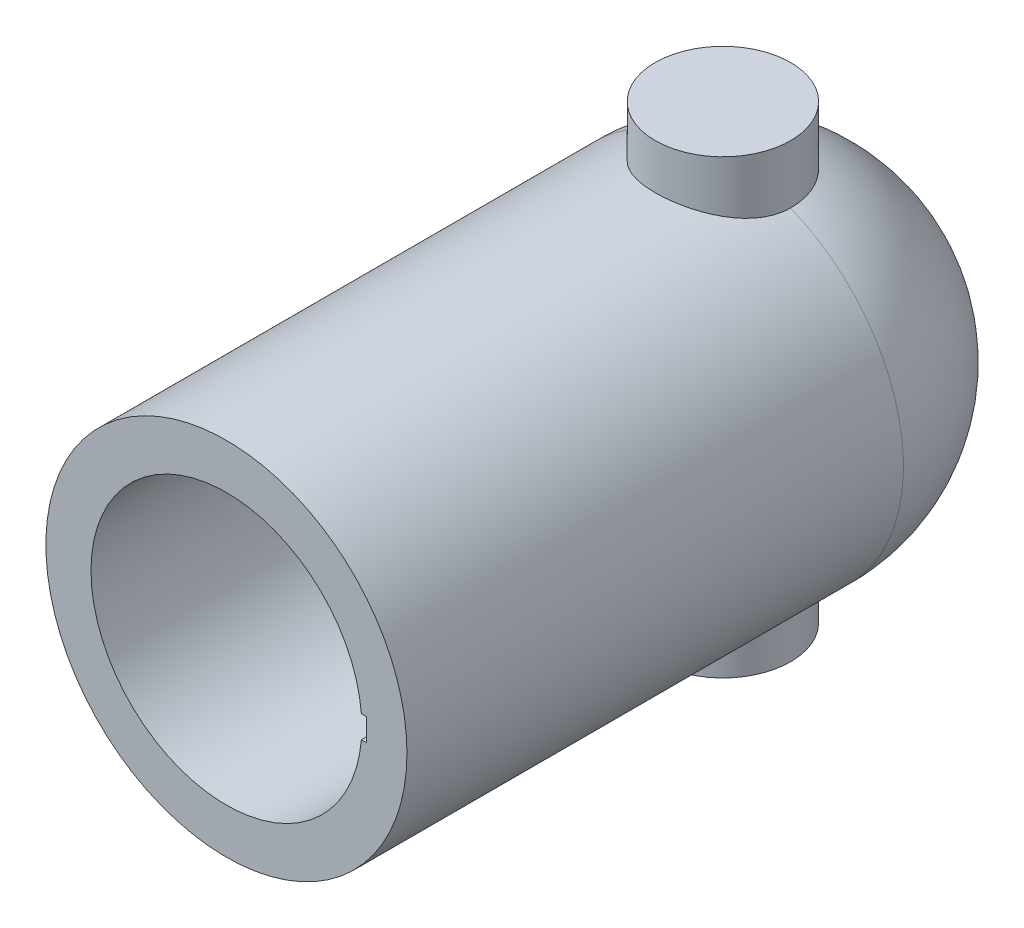
ISO-10303-21;
HEADER;
FILE_DESCRIPTION(('STEP AP214'),'2;1');
FILE_NAME('part.step','',(''),(''),'','','');
FILE_SCHEMA(('AUTOMOTIVE_DESIGN { 1 0 10303 214 1 1 1 1 }'));
ENDSEC;
DATA;
#1=APPLICATION_CONTEXT('core data for automotive mechanical design processes');
#2=APPLICATION_PROTOCOL_DEFINITION('international standard','automotive_design',2000,#1);
#3=PRODUCT_CONTEXT('',#1,'mechanical');
#4=PRODUCT('Part','Part','',(#3));
#5=PRODUCT_RELATED_PRODUCT_CATEGORY('part','',(#4));
#6=PRODUCT_DEFINITION_FORMATION('','',#4);
#7=PRODUCT_DEFINITION_CONTEXT('part definition',#1,'design');
#8=PRODUCT_DEFINITION('design','',#6,#7);
#9=PRODUCT_DEFINITION_SHAPE('','',#8);
#10=(LENGTH_UNIT() NAMED_UNIT(*) SI_UNIT(.MILLI.,.METRE.));
#11=(NAMED_UNIT(*) PLANE_ANGLE_UNIT() SI_UNIT($,.RADIAN.));
#12=(NAMED_UNIT(*) SI_UNIT($,.STERADIAN.) SOLID_ANGLE_UNIT());
#13=UNCERTAINTY_MEASURE_WITH_UNIT(LENGTH_MEASURE(1.E-05),#10,'distance_accuracy_value','');
#14=(GEOMETRIC_REPRESENTATION_CONTEXT(3) GLOBAL_UNCERTAINTY_ASSIGNED_CONTEXT((#13)) GLOBAL_UNIT_ASSIGNED_CONTEXT((#10,
#11,#12)) REPRESENTATION_CONTEXT('',''));
#15=CARTESIAN_POINT('',(0.,0.,0.));
#16=DIRECTION('',(0.,0.,1.));
#17=DIRECTION('',(1.,0.,0.));
#18=AXIS2_PLACEMENT_3D('',#15,#16,#17);
#19=CARTESIAN_POINT('',(0.,0.,110.));
#20=DIRECTION('',(0.,0.,-1.));
#21=DIRECTION('',(-1.,0.,0.));
#22=AXIS2_PLACEMENT_3D('',#19,#20,#21);
#23=CYLINDRICAL_SURFACE('',#22,40.);
#24=CARTESIAN_POINT('',(0.,0.,110.));
#25=DIRECTION('',(0.,0.,1.));
#26=DIRECTION('',(1.,0.,0.));
#27=AXIS2_PLACEMENT_3D('',#24,#25,#26);
#28=CIRCLE('',#27,40.);
#29=CARTESIAN_POINT('',(40.,0.,110.));
#30=VERTEX_POINT('',#29);
#31=EDGE_CURVE('E163',#30,#30,#28,.T.);
#32=ORIENTED_EDGE('',*,*,#31,.F.);
#33=EDGE_LOOP('',(#32));
#34=FACE_BOUND('',#33,.T.);
#35=CARTESIAN_POINT('',(0.,0.,0.));
#36=DIRECTION('',(0.,0.,1.));
#37=DIRECTION('',(1.,0.,0.));
#38=AXIS2_PLACEMENT_3D('',#35,#36,#37);
#39=CIRCLE('',#38,40.);
#40=CARTESIAN_POINT('',(-15.,-37.0809924354783,0.));
#41=VERTEX_POINT('',#40);
#42=CARTESIAN_POINT('',(-15.,37.0809924354783,0.));
#43=VERTEX_POINT('',#42);
#44=EDGE_CURVE('E159',#41,#43,#39,.F.);
#45=ORIENTED_EDGE('',*,*,#44,.F.);
#46=CARTESIAN_POINT('',(-15.,-37.0809924354783,0.));
#47=CARTESIAN_POINT('',(-15.0000007221759,-37.0809896004058,0.202915047880638));
#48=CARTESIAN_POINT('',(-14.995881766383,-37.0826586604734,0.405803448394228));
#49=CARTESIAN_POINT('',(-14.9794237192579,-37.0893108498808,0.811185065155254));
#50=CARTESIAN_POINT('',(-14.9670849183207,-37.0942938621435,1.01367829511003));
#51=CARTESIAN_POINT('',(-14.9177854527383,-37.1141620466237,1.61984876839462));
#52=CARTESIAN_POINT('',(-14.8685416785412,-37.1339664314965,2.02244358665115));
#53=CARTESIAN_POINT('',(-14.7380481828942,-37.1859490498419,2.82005972253651));
#54=CARTESIAN_POINT('',(-14.6569124635842,-37.2180831992268,3.21510281745749));
#55=CARTESIAN_POINT('',(-14.463432161637,-37.2936979435761,3.99638308407717));
#56=CARTESIAN_POINT('',(-14.3510859917467,-37.3371791156031,4.38261980683368));
#57=CARTESIAN_POINT('',(-14.0963655234954,-37.4340887776549,5.1432661069598));
#58=CARTESIAN_POINT('',(-13.9540250089708,-37.4875060683573,5.51768845036592));
#59=CARTESIAN_POINT('',(-13.6403722704029,-37.6027678610631,6.25300561653403));
#60=CARTESIAN_POINT('',(-13.4690490363859,-37.6646155638758,6.61389523458919));
#61=CARTESIAN_POINT('',(-13.0986969876726,-37.7950085485713,7.32005148646405));
#62=CARTESIAN_POINT('',(-12.8996585962851,-37.8635561430829,7.6653126651573));
#63=CARTESIAN_POINT('',(-12.4751794805119,-38.0055257847795,8.33836168233074));
#64=CARTESIAN_POINT('',(-12.2497265709667,-38.0789500747927,8.66614135423386));
#65=CARTESIAN_POINT('',(-11.7631759836972,-38.232127986495,9.31665123133496));
#66=CARTESIAN_POINT('',(-11.5009316206492,-38.312017758014,9.6384922256449));
#67=CARTESIAN_POINT('',(-10.9509499604344,-38.4728310957504,10.2590707781597));
#68=CARTESIAN_POINT('',(-10.6632229756421,-38.5537542325389,10.5578175913412));
#69=CARTESIAN_POINT('',(-10.0636884535762,-38.7145778486908,11.1307771685105));
#70=CARTESIAN_POINT('',(-9.75186676928882,-38.7944776946496,11.4049753118555));
#71=CARTESIAN_POINT('',(-9.10620183275623,-38.9510896942828,11.9268323468656));
#72=CARTESIAN_POINT('',(-8.77236685183303,-39.0278030278029,12.1745011159639));
#73=CARTESIAN_POINT('',(-8.07266870387881,-39.1786220320301,12.6497809430602));
#74=CARTESIAN_POINT('',(-7.70609938116705,-39.2525477116588,12.876411249585));
#75=CARTESIAN_POINT('',(-6.95367868042688,-39.3928012111105,13.297830041895));
#76=CARTESIAN_POINT('',(-6.56782673437548,-39.4591288069211,13.492617588941));
#77=CARTESIAN_POINT('',(-5.77958117233897,-39.5822623625999,13.8485879076685));
#78=CARTESIAN_POINT('',(-5.37719246987679,-39.6390711256641,14.0097805761099));
#79=CARTESIAN_POINT('',(-4.55869848217268,-39.7415188884893,14.297074971481));
#80=CARTESIAN_POINT('',(-4.14259395894614,-39.7871585075962,14.4231786442014));
#81=CARTESIAN_POINT('',(-3.31806725959532,-39.8641997086833,14.6343313157421));
#82=CARTESIAN_POINT('',(-2.91008757448774,-39.8961304034062,14.7209162049234));
#83=CARTESIAN_POINT('',(-2.08756866653245,-39.9476134473076,14.8598787826632));
#84=CARTESIAN_POINT('',(-1.67302961589426,-39.9671661209076,14.9122573677524));
#85=CARTESIAN_POINT('',(-0.840727476368681,-39.9933305341433,14.9822408768195));
#86=CARTESIAN_POINT('',(-0.422965255387619,-39.9999456432408,14.9998548549094));
#87=CARTESIAN_POINT('',(0.412566880959775,-40.000053680978,15.0001433430016));
#88=CARTESIAN_POINT('',(0.830336795711667,-39.9935470063214,14.9828189092778));
#89=CARTESIAN_POINT('',(1.64192961617363,-39.9682458655564,14.915146310516));
#90=CARTESIAN_POINT('',(2.03591339599853,-39.9500762276378,14.8664769873371));
#91=CARTESIAN_POINT('',(2.81811243546481,-39.9025281959383,14.7382259030498));
#92=CARTESIAN_POINT('',(3.20632792046859,-39.8731502412595,14.6586453529315));
#93=CARTESIAN_POINT('',(3.97437237693133,-39.8039326828568,14.4693058837781));
#94=CARTESIAN_POINT('',(4.35420116645342,-39.7640928524193,14.3595463107475));
#95=CARTESIAN_POINT('',(5.10302095522389,-39.6749463521343,14.1108058075852));
#96=CARTESIAN_POINT('',(5.47201167255185,-39.6256394362797,13.9718241180923));
#97=CARTESIAN_POINT('',(6.20216476213583,-39.5179871747799,13.6635451991575));
#98=CARTESIAN_POINT('',(6.56313576559587,-39.4595210247805,13.4938372217861));
#99=CARTESIAN_POINT('',(7.26947434801134,-39.3355225848619,13.1268107313546));
#100=CARTESIAN_POINT('',(7.61484186980956,-39.2699902690616,12.9294921171646));
#101=CARTESIAN_POINT('',(8.28808523529194,-39.1334338246637,12.5086074481219));
#102=CARTESIAN_POINT('',(8.6159595241159,-39.062409209261,12.2850390657312));
#103=CARTESIAN_POINT('',(9.2525569721247,-38.916537425438,11.8130131015397));
#104=CARTESIAN_POINT('',(9.56127267125643,-38.8416887884317,11.5645459217893));
#105=CARTESIAN_POINT('',(10.1751424344401,-38.6855595708018,11.0291356228081));
#106=CARTESIAN_POINT('',(10.4790490851385,-38.6041578610077,10.7407961752327));
#107=CARTESIAN_POINT('',(11.061819159659,-38.4412248384456,10.1396012182074));
#108=CARTESIAN_POINT('',(11.3406707295385,-38.3596934827114,9.82673423411552));
#109=CARTESIAN_POINT('',(11.8715810435381,-38.1987245237326,9.17830108936296));
#110=CARTESIAN_POINT('',(12.123628688312,-38.1192877980227,8.84272561864664));
#111=CARTESIAN_POINT('',(12.599027488316,-37.9648121938289,8.15110477980918));
#112=CARTESIAN_POINT('',(12.8223920667224,-37.889771267195,7.79506910046305));
#113=CARTESIAN_POINT('',(13.2438013099395,-37.7445700755978,7.05597994293308));
#114=CARTESIAN_POINT('',(13.4411359824194,-37.6745639820345,6.67249059595008));
#115=CARTESIAN_POINT('',(13.8024666637128,-37.5436925443645,5.88880372030133));
#116=CARTESIAN_POINT('',(13.9664770266391,-37.4828232676296,5.48861347530116));
#117=CARTESIAN_POINT('',(14.2595438861491,-37.3723151223753,4.67464110954791));
#118=CARTESIAN_POINT('',(14.3886411332444,-37.3226631722634,4.26087547231336));
#119=CARTESIAN_POINT('',(14.6107296077097,-37.2362832840386,3.42264563780551));
#120=CARTESIAN_POINT('',(14.7037371300128,-37.1995495139199,2.99818636124213));
#121=CARTESIAN_POINT('',(14.8518737739409,-37.1406540351504,2.14631434340682));
#122=CARTESIAN_POINT('',(14.9073959210204,-37.1183412353181,1.71898125645629));
#123=CARTESIAN_POINT('',(14.962940512901,-37.0959667877191,1.07553379383484));
#124=CARTESIAN_POINT('',(14.9768322578773,-37.0903577876014,0.860717381020728));
#125=CARTESIAN_POINT('',(14.9953626987493,-37.0828687128381,0.4306111911841));
#126=CARTESIAN_POINT('',(15.0000009687009,-37.0809888098455,0.215321392827933));
#127=CARTESIAN_POINT('',(15.,-37.0809924354783,0.));
#128=B_SPLINE_CURVE_WITH_KNOTS('',3,(#46,#47,#48,#49,#50,#51,#52,#53,#54,#55,#56,#57,#58,#59,
#60,#61,#62,#63,#64,#65,#66,#67,#68,#69,#70,#71,#72,#73,#74,#75,#76,#77,#78,#79,#80,#81,#82,#83,
#84,#85,#86,#87,#88,#89,#90,#91,#92,#93,#94,#95,#96,#97,#98,#99,#100,#101,#102,#103,#104,#105,
#106,#107,#108,#109,#110,#111,#112,#113,#114,#115,#116,#117,#118,#119,#120,#121,#122,#123,#124,
#125,#126,#127),.UNSPECIFIED.,.F.,.F.,(4,2,2,2,2,2,2,2,2,2,2,2,2,2,2,2,2,2,2,2,2,2,2,2,2,2,2,2,
2,2,2,2,2,2,2,2,2,2,2,2,4),(0.,0.608643573747014,1.21726564615811,2.43383176541719,
3.64608808276542,4.85840606246792,6.06936578938526,7.28078657371214,8.49262699576218,
9.70502866387933,10.9719263016379,12.2383135703289,13.5054501223093,14.7721132412638,
16.082270490914,17.3924663576439,18.7022757047535,20.0120124045036,21.26526971126,
22.5184941694284,23.7713921940886,25.0242523411386,26.2150339538436,27.4057689207374,
28.5965296935256,29.7873214130541,30.9953974406689,32.2034778932359,33.4116655459743,
34.6203207337467,35.8991490749851,37.178579298257,38.4585372797449,39.7378940631099,
41.0470160198552,42.3555728843839,43.6625957469533,44.9690277848077,46.2615401478372,
46.907353778511,47.5531971357618),.UNSPECIFIED.);
#129=CARTESIAN_POINT('',(15.,-37.0809924354783,0.));
#130=VERTEX_POINT('',#129);
#131=EDGE_CURVE('E55',#41,#130,#128,.T.);
#132=ORIENTED_EDGE('',*,*,#131,.T.);
#133=CARTESIAN_POINT('',(15.,37.0809924354783,0.));
#134=VERTEX_POINT('',#133);
#135=EDGE_CURVE('E160',#134,#130,#39,.F.);
#136=ORIENTED_EDGE('',*,*,#135,.F.);
#137=CARTESIAN_POINT('',(0.,40.,-15.));
#138=CARTESIAN_POINT('',(-0.406155231941303,40.0000013887431,-15.0000018921891));
#139=CARTESIAN_POINT('',(-0.812284348147753,39.9938006269279,-14.9834912647568));
#140=CARTESIAN_POINT('',(-1.62147139095104,39.9691710100067,-14.9176263231748));
#141=CARTESIAN_POINT('',(-2.02452957514366,39.9507431922111,-14.8682747951571));
#142=CARTESIAN_POINT('',(-2.82456330894158,39.9021609392328,-14.737236485769));
#143=CARTESIAN_POINT('',(-3.22153975126587,39.8720082425855,-14.6555544982452));
#144=CARTESIAN_POINT('',(-4.00666931290046,39.8007787911681,-14.4606436348404));
#145=CARTESIAN_POINT('',(-4.39482219784621,39.759701746601,-14.3474139220694));
#146=CARTESIAN_POINT('',(-5.15891467482713,39.6677879044666,-14.0906962888775));
#147=CARTESIAN_POINT('',(-5.53487700582704,39.6169706650972,-13.9472689490546));
#148=CARTESIAN_POINT('',(-6.27301569946846,39.5068163389401,-13.6312311889178));
#149=CARTESIAN_POINT('',(-6.63519216809261,39.4474793176674,-13.4586209930108));
#150=CARTESIAN_POINT('',(-7.34362780959022,39.3217570131001,-13.085542057312));
#151=CARTESIAN_POINT('',(-7.6898863174579,39.2553714357202,-12.8850721550282));
#152=CARTESIAN_POINT('',(-8.36464792699763,39.1171488135837,-12.4576177223872));
#153=CARTESIAN_POINT('',(-8.69314455467263,39.0453098037457,-12.230623618299));
#154=CARTESIAN_POINT('',(-9.34264058613321,38.8951200775699,-11.7425006030479));
#155=CARTESIAN_POINT('',(-9.66287704281832,38.816625532978,-11.4804004277814));
#156=CARTESIAN_POINT('',(-10.2803557268531,38.6576764432075,-10.930924091206));
#157=CARTESIAN_POINT('',(-10.5775973290844,38.5772218448226,-10.6435472432009));
#158=CARTESIAN_POINT('',(-11.1475099377515,38.4164124006621,-10.0450900797516));
#159=CARTESIAN_POINT('',(-11.4201695058726,38.3360576183078,-9.73399885270727));
#160=CARTESIAN_POINT('',(-11.9390379498077,38.1776498271183,-9.09011937523098));
#161=CARTESIAN_POINT('',(-12.1852557331364,38.0995960496066,-8.75733849254076));
#162=CARTESIAN_POINT('',(-12.6586805831567,37.9449890154007,-8.05869788128968));
#163=CARTESIAN_POINT('',(-12.8847959801516,37.8686081960778,-7.69205890956763));
#164=CARTESIAN_POINT('',(-13.3051847550507,37.7229581925958,-6.93958177388026));
#165=CARTESIAN_POINT('',(-13.4994571189537,37.6536892349313,-6.55374299903113));
#166=CARTESIAN_POINT('',(-13.8544333470209,37.5245301930475,-5.76553767808262));
#167=CARTESIAN_POINT('',(-14.015147681946,37.4646371848129,-5.36317633437897));
#168=CARTESIAN_POINT('',(-14.3015331739474,37.3562528480706,-4.54467839352252));
#169=CARTESIAN_POINT('',(-14.4272063865916,37.3077608507878,-4.12854260600324));
#170=CARTESIAN_POINT('',(-14.6377728200119,37.2256343859454,-3.30296471878725));
#171=CARTESIAN_POINT('',(-14.7241266556605,37.1914723133209,-2.8939476048363));
#172=CARTESIAN_POINT('',(-14.8624687487976,37.1364051781319,-2.06925422201619));
#173=CARTESIAN_POINT('',(-14.914457888768,37.1154997751382,-1.6535781244298));
#174=CARTESIAN_POINT('',(-14.9834733208266,37.0876922679378,-0.819013513193047));
#175=CARTESIAN_POINT('',(-15.00051204451,37.0807851846467,-0.400126194981082));
#176=CARTESIAN_POINT('',(-14.9994645645736,37.0812091486228,0.437588920160318));
#177=CARTESIAN_POINT('',(-14.9813797233542,37.0885396436317,0.856416718768245));
#178=CARTESIAN_POINT('',(-14.9124348098487,37.1163110276097,1.66558214103884));
#179=CARTESIAN_POINT('',(-14.8636042471798,37.1359397477468,2.05612270785485));
#180=CARTESIAN_POINT('',(-14.7355873547809,37.1869225256988,2.83139777918228));
#181=CARTESIAN_POINT('',(-14.656402420588,37.2182760444665,3.21613254976913));
#182=CARTESIAN_POINT('',(-14.4684135891209,37.291757457046,3.97727362567279));
#183=CARTESIAN_POINT('',(-14.3596065605833,37.3338864898767,4.35367904596791));
#184=CARTESIAN_POINT('',(-14.1133273980098,37.4276813895696,5.09576706427993));
#185=CARTESIAN_POINT('',(-13.9758543280917,37.479347567792,5.46144931176449));
#186=CARTESIAN_POINT('',(-13.6705139760041,37.5918075323209,6.18665666356201));
#187=CARTESIAN_POINT('',(-13.5021267029571,37.6527538500109,6.54593899565531));
#188=CARTESIAN_POINT('',(-13.1379428423647,37.7813677039867,7.24923025485661));
#189=CARTESIAN_POINT('',(-12.9421362090161,37.8490377010179,7.59323352295795));
#190=CARTESIAN_POINT('',(-12.5244597645839,37.9892935671165,8.26402000720255));
#191=CARTESIAN_POINT('',(-12.3025873820878,38.0618799208879,8.5908015197881));
#192=CARTESIAN_POINT('',(-11.834148656599,38.2101200096741,9.22542629083877));
#193=CARTESIAN_POINT('',(-11.5875811971466,38.2857738832788,9.53326869205388));
#194=CARTESIAN_POINT('',(-11.0537012467449,38.44344256231,10.1485258104847));
#195=CARTESIAN_POINT('',(-10.7647618949301,38.5255420356548,10.4545090845912));
#196=CARTESIAN_POINT('',(-10.1622074990615,38.688847504194,11.0411172613779));
#197=CARTESIAN_POINT('',(-9.84860247827213,38.7700538471902,11.3217523660818));
#198=CARTESIAN_POINT('',(-9.19826252614065,38.9294759681023,11.8561883007412));
#199=CARTESIAN_POINT('',(-8.86151413829134,39.007689964296,12.1099732974254));
#200=CARTESIAN_POINT('',(-8.16719019647369,39.1589476038946,12.5886750200747));
#201=CARTESIAN_POINT('',(-7.80962316257225,39.231993335683,12.8136034365821));
#202=CARTESIAN_POINT('',(-7.06994033251437,39.372069051516,13.2363223599273));
#203=CARTESIAN_POINT('',(-6.68752662946515,39.4389861908746,13.433629744047));
#204=CARTESIAN_POINT('',(-5.90588698531559,39.5635829668856,13.7951405830679));
#205=CARTESIAN_POINT('',(-5.50666073576374,39.6212624339658,13.9593434302963));
#206=CARTESIAN_POINT('',(-4.69439988189091,39.7256868620305,14.2530361633294));
#207=CARTESIAN_POINT('',(-4.28137030067997,39.7724357522422,14.3825385254094));
#208=CARTESIAN_POINT('',(-3.44453132425186,39.8536306085204,14.6055701415171));
#209=CARTESIAN_POINT('',(-3.02072257585327,39.8880773109393,14.6991015486268));
#210=CARTESIAN_POINT('',(-2.18849551644941,39.9421460522352,14.8451800918348));
#211=CARTESIAN_POINT('',(-1.78045741668368,39.962459083635,14.8996423544147));
#212=CARTESIAN_POINT('',(-0.960859723782186,39.990559498139,14.9748481071268));
#213=CARTESIAN_POINT('',(-0.549300256077098,39.9983473255374,14.9955927932897));
#214=CARTESIAN_POINT('',(0.274091236191257,40.0011792980538,15.0031448468052));
#215=CARTESIAN_POINT('',(0.685923192079355,39.9962259242751,14.9899588215095));
#216=CARTESIAN_POINT('',(1.50675968753968,39.9737193163572,14.9298029053099));
#217=CARTESIAN_POINT('',(1.91576427005508,39.9561662740128,14.8828335286632));
#218=CARTESIAN_POINT('',(2.71219474626321,39.9098605286727,14.7580545154331));
#219=CARTESIAN_POINT('',(3.09984517091598,39.8815650325298,14.6815018544886));
#220=CARTESIAN_POINT('',(3.86703155017863,39.8144990406299,14.4983307144838));
#221=CARTESIAN_POINT('',(4.24656776694291,39.7757288838425,14.3917132083446));
#222=CARTESIAN_POINT('',(4.99511663749267,39.6886736461039,14.1493321365659));
#223=CARTESIAN_POINT('',(5.36412841855628,39.6403877786885,14.0135661617513));
#224=CARTESIAN_POINT('',(6.08935991488233,39.535477262355,13.7139942249234));
#225=CARTESIAN_POINT('',(6.44557921228686,39.4788523413548,13.5501873479789));
#226=CARTESIAN_POINT('',(7.1534241639373,39.3568452542715,13.1905538364841));
#227=CARTESIAN_POINT('',(7.50460797444908,39.291254805882,12.9939283840587));
#228=CARTESIAN_POINT('',(8.18924056088558,39.1542875668433,12.5736901626576));
#229=CARTESIAN_POINT('',(8.52268909183351,39.0829106963008,12.3500770210413));
#230=CARTESIAN_POINT('',(9.17007857656462,38.9360996297209,11.8773036099785));
#231=CARTESIAN_POINT('',(9.48401656566001,38.8606648203001,11.6281394731482));
#232=CARTESIAN_POINT('',(10.0907594848575,38.7075512388676,11.1057150746496));
#233=CARTESIAN_POINT('',(10.3835568271633,38.6298716750388,10.8324462387436));
#234=CARTESIAN_POINT('',(10.9626367898233,38.4696763411679,10.2469406946293));
#235=CARTESIAN_POINT('',(11.2475607613895,38.3871409551207,9.93336387941289));
#236=CARTESIAN_POINT('',(11.790108036202,38.2239928073906,9.28292651112911));
#237=CARTESIAN_POINT('',(12.0477298744787,38.1433801490565,8.94606471024383));
#238=CARTESIAN_POINT('',(12.5340206849557,37.9863613419296,8.25095652734945));
#239=CARTESIAN_POINT('',(12.7626808458368,37.9099564772955,7.89270368586223));
#240=CARTESIAN_POINT('',(13.189195002037,37.7636858295333,7.15721790902111));
#241=CARTESIAN_POINT('',(13.3870613549922,37.6938174278186,6.77999266817323));
#242=CARTESIAN_POINT('',(13.7512889130172,37.5624776292406,6.00710818241804));
#243=CARTESIAN_POINT('',(13.9175068446813,37.501044754149,5.611374758442));
#244=CARTESIAN_POINT('',(14.2158139686818,37.3889830200382,4.80573904587995));
#245=CARTESIAN_POINT('',(14.3479028565703,37.3383542573976,4.39583663093653));
#246=CARTESIAN_POINT('',(14.5765364210781,37.2496931258823,3.56511887279179));
#247=CARTESIAN_POINT('',(14.6730994876903,37.2116542408657,3.14430929680767));
#248=CARTESIAN_POINT('',(14.8296900889223,37.1495278854578,2.29493763664646));
#249=CARTESIAN_POINT('',(14.8897201716976,37.1254394420366,1.86637609531221));
#250=CARTESIAN_POINT('',(14.9698774840286,37.0931865199998,1.03279571294562));
#251=CARTESIAN_POINT('',(14.9923210727599,37.0840982023262,0.628033782713863));
#252=CARTESIAN_POINT('',(15.0043637110964,37.0792276534441,-0.182049500865566));
#253=CARTESIAN_POINT('',(14.9939642311019,37.0834448265423,-0.587370828356663));
#254=CARTESIAN_POINT('',(14.9404378514227,37.1050419619324,-1.39544836691884));
#255=CARTESIAN_POINT('',(14.8973139414604,37.1224207217742,-1.7982048089299));
#256=CARTESIAN_POINT('',(14.7788002566835,37.1697608730416,-2.59818531238206));
#257=CARTESIAN_POINT('',(14.7034105043358,37.199722255706,-2.99540937767521));
#258=CARTESIAN_POINT('',(14.5239224261862,37.270157700168,-3.76943807165762));
#259=CARTESIAN_POINT('',(14.4207734812718,37.3102819057482,-4.14649555455117));
#260=CARTESIAN_POINT('',(14.1857898073017,37.4002564193183,-4.89034774478462));
#261=CARTESIAN_POINT('',(14.0539558787024,37.4501064559042,-5.25714273817778));
#262=CARTESIAN_POINT('',(13.7626630336337,37.558131175397,-5.97832397627086));
#263=CARTESIAN_POINT('',(13.6032033075099,37.6163061022804,-6.33270985691965));
#264=CARTESIAN_POINT('',(13.2577706379718,37.7394373994892,-7.0272332091732));
#265=CARTESIAN_POINT('',(13.0717881001393,37.804396221549,-7.3673654667813));
#266=CARTESIAN_POINT('',(12.6641940148662,37.9429426303286,-8.04884784208206));
#267=CARTESIAN_POINT('',(12.4412285835312,38.0168037297325,-8.38933298500504));
#268=CARTESIAN_POINT('',(11.9688197830464,38.1681655144787,-9.05055057946654));
#269=CARTESIAN_POINT('',(11.7193755752939,38.2456663150497,-9.37128240489396));
#270=CARTESIAN_POINT('',(11.1954065584279,38.4023131740956,-9.99138166266443));
#271=CARTESIAN_POINT('',(10.9208706472744,38.481459948765,-10.2907395325536));
#272=CARTESIAN_POINT('',(10.348471530804,38.6393224858589,-10.8661762002066));
#273=CARTESIAN_POINT('',(10.0506156438929,38.718038375275,-11.1422622452312));
#274=CARTESIAN_POINT('',(9.41632697024719,38.8773122669273,-11.6840083856835));
#275=CARTESIAN_POINT('',(9.0786771669714,38.9577376446488,-11.948284952933));
#276=CARTESIAN_POINT('',(8.38122903939964,39.113714726014,-12.4474457240724));
#277=CARTESIAN_POINT('',(8.02143011187376,39.1892662968051,-12.6823291269126));
#278=CARTESIAN_POINT('',(7.28190441958342,39.3333925489983,-13.1209255557869));
#279=CARTESIAN_POINT('',(6.90217541271582,39.4019664428614,-13.3246350646686));
#280=CARTESIAN_POINT('',(6.12534658267169,39.5301795476009,-13.6991261587392));
#281=CARTESIAN_POINT('',(5.72824648327022,39.589818616334,-13.8699072200856));
#282=CARTESIAN_POINT('',(4.90189687575751,39.7007883981909,-14.183620230087));
#283=CARTESIAN_POINT('',(4.47200013929826,39.7516456511957,-14.3250201303173));
#284=CARTESIAN_POINT('',(3.59988024064192,39.8400922813996,-14.5686599248724));
#285=CARTESIAN_POINT('',(3.15765646099724,39.8776809926995,-14.670897853824));
#286=CARTESIAN_POINT('',(2.2649749380195,39.9383266044979,-14.8349501893944));
#287=CARTESIAN_POINT('',(1.81452074029841,39.9613896174616,-14.8967815996312));
#288=CARTESIAN_POINT('',(0.909366462952385,39.9922246755778,-14.9793031256919));
#289=CARTESIAN_POINT('',(0.454666868030223,39.9999984453839,-14.9999978818057));
#290=CARTESIAN_POINT('',(0.,40.,-15.));
#291=B_SPLINE_CURVE_WITH_KNOTS('',3,(#137,#138,#139,#140,#141,#142,#143,#144,#145,#146,#147,
#148,#149,#150,#151,#152,#153,#154,#155,#156,#157,#158,#159,#160,#161,#162,#163,#164,#165,#166,
#167,#168,#169,#170,#171,#172,#173,#174,#175,#176,#177,#178,#179,#180,#181,#182,#183,#184,#185,
#186,#187,#188,#189,#190,#191,#192,#193,#194,#195,#196,#197,#198,#199,#200,#201,#202,#203,#204,
#205,#206,#207,#208,#209,#210,#211,#212,#213,#214,#215,#216,#217,#218,#219,#220,#221,#222,#223,
#224,#225,#226,#227,#228,#229,#230,#231,#232,#233,#234,#235,#236,#237,#238,#239,#240,#241,#242,
#243,#244,#245,#246,#247,#248,#249,#250,#251,#252,#253,#254,#255,#256,#257,#258,#259,#260,#261,
#262,#263,#264,#265,#266,#267,#268,#269,#270,#271,#272,#273,#274,#275,#276,#277,#278,#279,#280,
#281,#282,#283,#284,#285,#286,#287,#288,#289,#290),.UNSPECIFIED.,.T.,.F.,(4,2,2,2,2,2,2,2,2,2,2,
2,2,2,2,2,2,2,2,2,2,2,2,2,2,2,2,2,2,2,2,2,2,2,2,2,2,2,2,2,2,2,2,2,2,2,2,2,2,2,2,2,2,2,2,2,2,2,2,
2,2,2,2,2,2,2,2,2,2,2,2,2,2,2,2,2,4),(0.,1.21803976956057,2.43597621713674,3.65373214099882,
4.87152037225308,6.08688844231484,7.30224716700768,8.51765661977119,9.73350612938794,
10.9956964679824,12.2579211073466,13.5207300759098,14.7831122953106,16.0939232170195,
17.4047758717498,18.7152189016251,20.0255850426486,21.2822308209684,22.538844327505,
23.7950107886898,25.0511285256742,26.2319550333797,27.412727259297,28.5936243496274,
29.7745599996476,30.9775647468564,32.1810114052859,33.3845768847911,34.5881968018334,
35.873060131562,37.157404008973,38.4425010801098,39.7270758702025,41.0318791223794,
42.3367063235757,43.6410637534127,44.9453430973126,46.180256651397,47.4151263996391,
48.6497556990084,49.8843662049953,51.071444017575,52.2584834198288,53.4456209708951,
54.6327972638094,55.8548248603576,57.0768693323477,58.2990990460617,59.5217652836715,
60.8152199534079,62.1087439918367,63.402660632329,64.6960566742373,65.9951755572421,
67.2943060286289,68.5927630538542,69.8911295020356,71.1060594166908,72.3209349391056,
73.5356994831678,74.750463181382,75.9280439339243,77.1055918302024,78.2831742437826,
79.4611837241906,80.7007450797818,81.9403457049348,83.1804974820594,84.4202616159006,
85.7274480366866,87.0346700743708,88.3420394890538,89.6494297003216,91.0136133518112,
92.3778654569305,93.7415430957105,95.1050669004276),.UNSPECIFIED.);
#292=EDGE_CURVE('E153',#43,#134,#291,.T.);
#293=ORIENTED_EDGE('',*,*,#292,.F.);
#294=EDGE_LOOP('',(#45,#132,#136,#293));
#295=FACE_BOUND('',#294,.T.);
#296=ADVANCED_FACE('F33',(#34,#295),#23,.T.);
#297=CARTESIAN_POINT('',(0.,0.,0.));
#298=DIRECTION('',(0.,1.,0.));
#299=DIRECTION('',(0.,0.,-1.));
#300=AXIS2_PLACEMENT_3D('',#297,#298,#299);
#301=SPHERICAL_SURFACE('',#300,40.);
#302=ORIENTED_EDGE('',*,*,#135,.T.);
#303=CARTESIAN_POINT('',(0.,-37.0809924354783,0.));
#304=DIRECTION('',(0.,1.,0.));
#305=DIRECTION('',(0.,0.,1.));
#306=AXIS2_PLACEMENT_3D('',#303,#304,#305);
#307=CIRCLE('',#306,15.);
#308=EDGE_CURVE('E11',#130,#41,#307,.T.);
#309=ORIENTED_EDGE('',*,*,#308,.T.);
#310=ORIENTED_EDGE('',*,*,#44,.T.);
#311=CARTESIAN_POINT('',(0.,37.0809924354783,0.));
#312=DIRECTION('',(0.,-1.,0.));
#313=DIRECTION('',(0.,0.,-1.));
#314=AXIS2_PLACEMENT_3D('',#311,#312,#313);
#315=CIRCLE('',#314,15.);
#316=EDGE_CURVE('E41',#134,#43,#315,.F.);
#317=ORIENTED_EDGE('',*,*,#316,.F.);
#318=EDGE_LOOP('',(#302,#309,#310,#317));
#319=FACE_BOUND('',#318,.T.);
#320=ADVANCED_FACE('F152',(#319),#301,.T.);
#321=CARTESIAN_POINT('',(0.,0.,110.));
#322=DIRECTION('',(0.,0.,1.));
#323=DIRECTION('',(1.,0.,0.));
#324=AXIS2_PLACEMENT_3D('',#321,#322,#323);
#325=PLANE('',#324);
#326=DIRECTION('',(1.,0.,0.));
#327=VECTOR('',#326,1.);
#328=CARTESIAN_POINT('',(0.,-2.5,110.));
#329=LINE('',#328,#327);
#330=CARTESIAN_POINT('',(29.8956518577535,-2.5,110.));
#331=VERTEX_POINT('',#330);
#332=CARTESIAN_POINT('',(31.,-2.5,110.));
#333=VERTEX_POINT('',#332);
#334=EDGE_CURVE('E105',#331,#333,#329,.T.);
#335=ORIENTED_EDGE('',*,*,#334,.F.);
#336=CARTESIAN_POINT('',(0.,0.,110.));
#337=DIRECTION('',(0.,0.,1.));
#338=DIRECTION('',(1.,0.,0.));
#339=AXIS2_PLACEMENT_3D('',#336,#337,#338);
#340=CIRCLE('',#339,30.);
#341=CARTESIAN_POINT('',(29.8956518577535,2.5,110.));
#342=VERTEX_POINT('',#341);
#343=EDGE_CURVE('E118',#342,#331,#340,.T.);
#344=ORIENTED_EDGE('',*,*,#343,.F.);
#345=DIRECTION('',(-1.,0.,0.));
#346=VECTOR('',#345,1.);
#347=CARTESIAN_POINT('',(0.,2.5,110.));
#348=LINE('',#347,#346);
#349=CARTESIAN_POINT('',(31.,2.5,110.));
#350=VERTEX_POINT('',#349);
#351=EDGE_CURVE('E107',#350,#342,#348,.T.);
#352=ORIENTED_EDGE('',*,*,#351,.F.);
#353=DIRECTION('',(0.,1.,0.));
#354=VECTOR('',#353,1.);
#355=CARTESIAN_POINT('',(31.,2.5,110.));
#356=LINE('',#355,#354);
#357=EDGE_CURVE('E92',#333,#350,#356,.T.);
#358=ORIENTED_EDGE('',*,*,#357,.F.);
#359=EDGE_LOOP('',(#335,#344,#352,#358));
#360=FACE_BOUND('',#359,.T.);
#361=ORIENTED_EDGE('',*,*,#31,.T.);
#362=EDGE_LOOP('',(#361));
#363=FACE_BOUND('',#362,.T.);
#364=ADVANCED_FACE('F150',(#360,#363),#325,.T.);
#365=CARTESIAN_POINT('',(0.,50.,0.));
#366=DIRECTION('',(0.,-1.,0.));
#367=DIRECTION('',(0.,0.,-1.));
#368=AXIS2_PLACEMENT_3D('',#365,#366,#367);
#369=CYLINDRICAL_SURFACE('',#368,15.);
#370=CARTESIAN_POINT('',(0.,50.,0.));
#371=DIRECTION('',(0.,1.,0.));
#372=DIRECTION('',(0.,0.,1.));
#373=AXIS2_PLACEMENT_3D('',#370,#371,#372);
#374=CIRCLE('',#373,15.);
#375=CARTESIAN_POINT('',(0.,50.,15.));
#376=VERTEX_POINT('',#375);
#377=EDGE_CURVE('E132',#376,#376,#374,.T.);
#378=ORIENTED_EDGE('',*,*,#377,.F.);
#379=EDGE_LOOP('',(#378));
#380=FACE_BOUND('',#379,.T.);
#381=ORIENTED_EDGE('',*,*,#316,.T.);
#382=ORIENTED_EDGE('',*,*,#292,.T.);
#383=EDGE_LOOP('',(#381,#382));
#384=FACE_BOUND('',#383,.T.);
#385=ADVANCED_FACE('F145',(#380,#384),#369,.T.);
#386=CARTESIAN_POINT('',(0.,50.,0.));
#387=DIRECTION('',(0.,1.,0.));
#388=DIRECTION('',(0.,0.,1.));
#389=AXIS2_PLACEMENT_3D('',#386,#387,#388);
#390=PLANE('',#389);
#391=ORIENTED_EDGE('',*,*,#377,.T.);
#392=EDGE_LOOP('',(#391));
#393=FACE_BOUND('',#392,.T.);
#394=ADVANCED_FACE('F140',(#393),#390,.T.);
#395=CARTESIAN_POINT('',(0.,-50.,0.));
#396=DIRECTION('',(0.,1.,0.));
#397=DIRECTION('',(0.,0.,1.));
#398=AXIS2_PLACEMENT_3D('',#395,#396,#397);
#399=CYLINDRICAL_SURFACE('',#398,15.);
#400=CARTESIAN_POINT('',(0.,-50.,0.));
#401=DIRECTION('',(0.,1.,0.));
#402=DIRECTION('',(0.,0.,1.));
#403=AXIS2_PLACEMENT_3D('',#400,#401,#402);
#404=CIRCLE('',#403,15.);
#405=CARTESIAN_POINT('',(0.,-50.,15.));
#406=VERTEX_POINT('',#405);
#407=EDGE_CURVE('E121',#406,#406,#404,.T.);
#408=ORIENTED_EDGE('',*,*,#407,.T.);
#409=EDGE_LOOP('',(#408));
#410=FACE_BOUND('',#409,.T.);
#411=ORIENTED_EDGE('',*,*,#131,.F.);
#412=ORIENTED_EDGE('',*,*,#308,.F.);
#413=EDGE_LOOP('',(#411,#412));
#414=FACE_BOUND('',#413,.T.);
#415=ADVANCED_FACE('F134',(#410,#414),#399,.T.);
#416=CARTESIAN_POINT('',(0.,-50.,0.));
#417=DIRECTION('',(0.,1.,0.));
#418=DIRECTION('',(0.,0.,1.));
#419=AXIS2_PLACEMENT_3D('',#416,#417,#418);
#420=PLANE('',#419);
#421=ORIENTED_EDGE('',*,*,#407,.F.);
#422=EDGE_LOOP('',(#421));
#423=FACE_BOUND('',#422,.T.);
#424=ADVANCED_FACE('F139',(#423),#420,.F.);
#425=CARTESIAN_POINT('',(0.,0.,9.99999999999999));
#426=DIRECTION('',(0.,0.,1.));
#427=DIRECTION('',(1.,0.,0.));
#428=AXIS2_PLACEMENT_3D('',#425,#426,#427);
#429=CYLINDRICAL_SURFACE('',#428,30.);
#430=ORIENTED_EDGE('',*,*,#343,.T.);
#431=DIRECTION('',(0.,0.,1.));
#432=VECTOR('',#431,1.);
#433=CARTESIAN_POINT('',(29.8956518577535,-2.5,9.99999999999999));
#434=LINE('',#433,#432);
#435=CARTESIAN_POINT('',(29.8956518577535,-2.5,9.99999999999999));
#436=VERTEX_POINT('',#435);
#437=EDGE_CURVE('E115',#331,#436,#434,.F.);
#438=ORIENTED_EDGE('',*,*,#437,.T.);
#439=CARTESIAN_POINT('',(0.,0.,9.99999999999999));
#440=DIRECTION('',(0.,0.,1.));
#441=DIRECTION('',(1.,0.,0.));
#442=AXIS2_PLACEMENT_3D('',#439,#440,#441);
#443=CIRCLE('',#442,30.);
#444=CARTESIAN_POINT('',(29.8956518577535,2.5,9.99999999999999));
#445=VERTEX_POINT('',#444);
#446=EDGE_CURVE('E119',#445,#436,#443,.T.);
#447=ORIENTED_EDGE('',*,*,#446,.F.);
#448=DIRECTION('',(0.,0.,1.));
#449=VECTOR('',#448,1.);
#450=CARTESIAN_POINT('',(29.8956518577535,2.5,9.99999999999999));
#451=LINE('',#450,#449);
#452=EDGE_CURVE('E100',#445,#342,#451,.T.);
#453=ORIENTED_EDGE('',*,*,#452,.T.);
#454=EDGE_LOOP('',(#430,#438,#447,#453));
#455=FACE_BOUND('',#454,.T.);
#456=ADVANCED_FACE('F187',(#455),#429,.F.);
#457=CARTESIAN_POINT('',(0.,0.,9.99999999999999));
#458=DIRECTION('',(0.,0.,1.));
#459=DIRECTION('',(1.,0.,0.));
#460=AXIS2_PLACEMENT_3D('',#457,#458,#459);
#461=PLANE('',#460);
#462=ORIENTED_EDGE('',*,*,#446,.T.);
#463=DIRECTION('',(1.,0.,0.));
#464=VECTOR('',#463,1.);
#465=CARTESIAN_POINT('',(0.,-2.5,9.99999999999999));
#466=LINE('',#465,#464);
#467=CARTESIAN_POINT('',(31.,-2.5,9.99999999999999));
#468=VERTEX_POINT('',#467);
#469=EDGE_CURVE('E96',#436,#468,#466,.T.);
#470=ORIENTED_EDGE('',*,*,#469,.T.);
#471=DIRECTION('',(0.,1.,0.));
#472=VECTOR('',#471,1.);
#473=CARTESIAN_POINT('',(31.,2.5,9.99999999999999));
#474=LINE('',#473,#472);
#475=CARTESIAN_POINT('',(31.,2.5,9.99999999999999));
#476=VERTEX_POINT('',#475);
#477=EDGE_CURVE('E90',#468,#476,#474,.T.);
#478=ORIENTED_EDGE('',*,*,#477,.T.);
#479=DIRECTION('',(-1.,0.,0.));
#480=VECTOR('',#479,1.);
#481=CARTESIAN_POINT('',(0.,2.5,9.99999999999999));
#482=LINE('',#481,#480);
#483=EDGE_CURVE('E48',#476,#445,#482,.T.);
#484=ORIENTED_EDGE('',*,*,#483,.T.);
#485=EDGE_LOOP('',(#462,#470,#478,#484));
#486=FACE_BOUND('',#485,.T.);
#487=ADVANCED_FACE('F103',(#486),#461,.T.);
#488=CARTESIAN_POINT('',(0.,-2.5,9.99999999999999));
#489=DIRECTION('',(0.,-1.,0.));
#490=DIRECTION('',(0.,0.,-1.));
#491=AXIS2_PLACEMENT_3D('',#488,#489,#490);
#492=PLANE('',#491);
#493=ORIENTED_EDGE('',*,*,#334,.T.);
#494=DIRECTION('',(0.,0.,1.));
#495=VECTOR('',#494,1.);
#496=CARTESIAN_POINT('',(31.,-2.5,9.99999999999999));
#497=LINE('',#496,#495);
#498=EDGE_CURVE('E95',#468,#333,#497,.T.);
#499=ORIENTED_EDGE('',*,*,#498,.F.);
#500=ORIENTED_EDGE('',*,*,#469,.F.);
#501=ORIENTED_EDGE('',*,*,#437,.F.);
#502=EDGE_LOOP('',(#493,#499,#500,#501));
#503=FACE_BOUND('',#502,.T.);
#504=ADVANCED_FACE('F188',(#503),#492,.F.);
#505=CARTESIAN_POINT('',(0.,2.5,9.99999999999999));
#506=DIRECTION('',(0.,1.,0.));
#507=DIRECTION('',(-1.,0.,0.));
#508=AXIS2_PLACEMENT_3D('',#505,#506,#507);
#509=PLANE('',#508);
#510=ORIENTED_EDGE('',*,*,#483,.F.);
#511=DIRECTION('',(0.,0.,1.));
#512=VECTOR('',#511,1.);
#513=CARTESIAN_POINT('',(31.,2.5,9.99999999999999));
#514=LINE('',#513,#512);
#515=EDGE_CURVE('E87',#476,#350,#514,.T.);
#516=ORIENTED_EDGE('',*,*,#515,.T.);
#517=ORIENTED_EDGE('',*,*,#351,.T.);
#518=ORIENTED_EDGE('',*,*,#452,.F.);
#519=EDGE_LOOP('',(#510,#516,#517,#518));
#520=FACE_BOUND('',#519,.T.);
#521=ADVANCED_FACE('F98',(#520),#509,.F.);
#522=CARTESIAN_POINT('',(31.,2.5,9.99999999999999));
#523=DIRECTION('',(1.,0.,0.));
#524=DIRECTION('',(0.,0.,-1.));
#525=AXIS2_PLACEMENT_3D('',#522,#523,#524);
#526=PLANE('',#525);
#527=ORIENTED_EDGE('',*,*,#357,.T.);
#528=ORIENTED_EDGE('',*,*,#515,.F.);
#529=ORIENTED_EDGE('',*,*,#477,.F.);
#530=ORIENTED_EDGE('',*,*,#498,.T.);
#531=EDGE_LOOP('',(#527,#528,#529,#530));
#532=FACE_BOUND('',#531,.T.);
#533=ADVANCED_FACE('F88',(#532),#526,.F.);
#534=CLOSED_SHELL('',(#296,#320,#364,#385,#394,#415,#424,#456,#487,#504,#521,#533));
#535=MANIFOLD_SOLID_BREP('B2',#534);
#536=ADVANCED_BREP_SHAPE_REPRESENTATION('',(#18,#535),#14);
#537=SHAPE_DEFINITION_REPRESENTATION(#9,#536);
ENDSEC;
END-ISO-10303-21;
